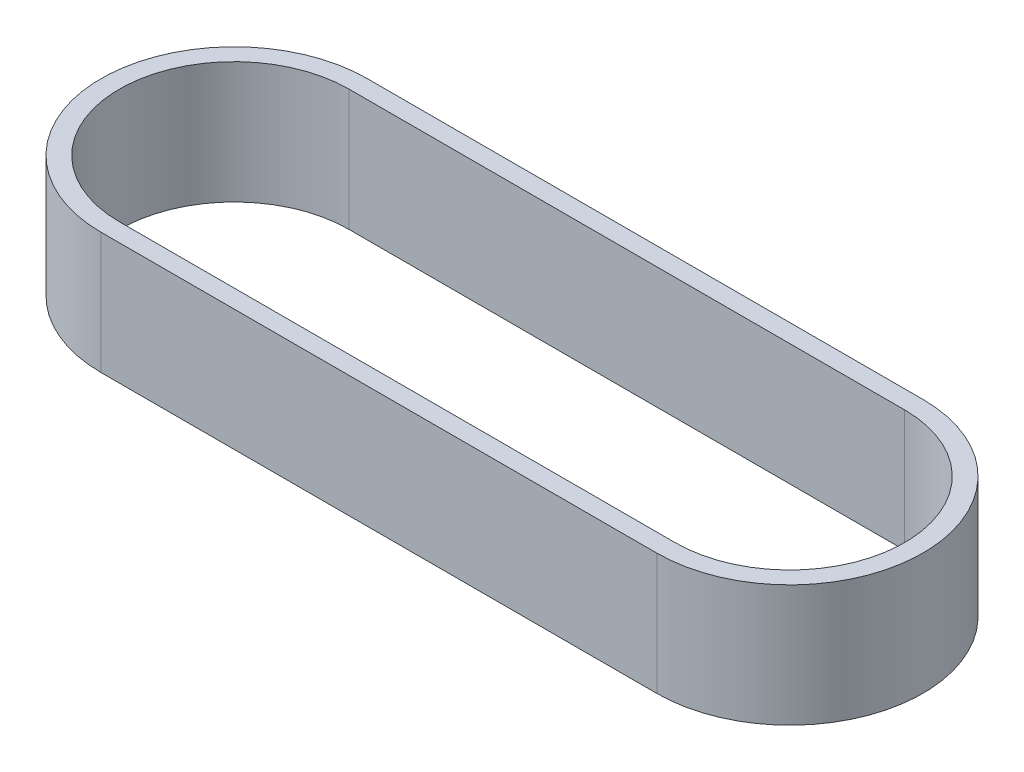
ISO-10303-21;
HEADER;
FILE_DESCRIPTION(('STEP AP214'),'2;1');
FILE_NAME('part.step','',(''),(''),'','','');
FILE_SCHEMA(('AUTOMOTIVE_DESIGN { 1 0 10303 214 1 1 1 1 }'));
ENDSEC;
DATA;
#1=APPLICATION_CONTEXT('core data for automotive mechanical design processes');
#2=APPLICATION_PROTOCOL_DEFINITION('international standard','automotive_design',2000,#1);
#3=PRODUCT_CONTEXT('',#1,'mechanical');
#4=PRODUCT('Part','Part','',(#3));
#5=PRODUCT_RELATED_PRODUCT_CATEGORY('part','',(#4));
#6=PRODUCT_DEFINITION_FORMATION('','',#4);
#7=PRODUCT_DEFINITION_CONTEXT('part definition',#1,'design');
#8=PRODUCT_DEFINITION('design','',#6,#7);
#9=PRODUCT_DEFINITION_SHAPE('','',#8);
#10=(LENGTH_UNIT() NAMED_UNIT(*) SI_UNIT(.MILLI.,.METRE.));
#11=(NAMED_UNIT(*) PLANE_ANGLE_UNIT() SI_UNIT($,.RADIAN.));
#12=(NAMED_UNIT(*) SI_UNIT($,.STERADIAN.) SOLID_ANGLE_UNIT());
#13=UNCERTAINTY_MEASURE_WITH_UNIT(LENGTH_MEASURE(1.E-05),#10,'distance_accuracy_value','');
#14=(GEOMETRIC_REPRESENTATION_CONTEXT(3) GLOBAL_UNCERTAINTY_ASSIGNED_CONTEXT((#13)) GLOBAL_UNIT_ASSIGNED_CONTEXT((#10,
#11,#12)) REPRESENTATION_CONTEXT('',''));
#15=CARTESIAN_POINT('',(0.,0.,0.));
#16=DIRECTION('',(0.,0.,1.));
#17=DIRECTION('',(1.,0.,0.));
#18=AXIS2_PLACEMENT_3D('',#15,#16,#17);
#19=CARTESIAN_POINT('',(0.,10.,0.));
#20=DIRECTION('',(0.,1.,0.));
#21=DIRECTION('',(0.,0.,1.));
#22=AXIS2_PLACEMENT_3D('',#19,#20,#21);
#23=PLANE('',#22);
#24=CARTESIAN_POINT('',(0.,10.,0.));
#25=DIRECTION('',(0.,1.,0.));
#26=DIRECTION('',(0.,0.,1.));
#27=AXIS2_PLACEMENT_3D('',#24,#25,#26);
#28=CIRCLE('',#27,10.95);
#29=CARTESIAN_POINT('',(0.,10.,-10.95));
#30=VERTEX_POINT('',#29);
#31=CARTESIAN_POINT('',(0.,10.,10.95));
#32=VERTEX_POINT('',#31);
#33=EDGE_CURVE('E138',#30,#32,#28,.T.);
#34=ORIENTED_EDGE('',*,*,#33,.T.);
#35=DIRECTION('',(1.,0.,0.));
#36=VECTOR('',#35,1.);
#37=CARTESIAN_POINT('',(0.,10.,10.95));
#38=LINE('',#37,#36);
#39=CARTESIAN_POINT('',(45.72,10.,10.95));
#40=VERTEX_POINT('',#39);
#41=EDGE_CURVE('E141',#32,#40,#38,.T.);
#42=ORIENTED_EDGE('',*,*,#41,.T.);
#43=CARTESIAN_POINT('',(45.72,10.,0.));
#44=DIRECTION('',(0.,1.,0.));
#45=DIRECTION('',(0.,0.,1.));
#46=AXIS2_PLACEMENT_3D('',#43,#44,#45);
#47=CIRCLE('',#46,10.95);
#48=CARTESIAN_POINT('',(45.72,10.,-10.95));
#49=VERTEX_POINT('',#48);
#50=EDGE_CURVE('E144',#40,#49,#47,.T.);
#51=ORIENTED_EDGE('',*,*,#50,.T.);
#52=DIRECTION('',(-1.,0.,0.));
#53=VECTOR('',#52,1.);
#54=CARTESIAN_POINT('',(0.,10.,-10.95));
#55=LINE('',#54,#53);
#56=EDGE_CURVE('E146',#49,#30,#55,.T.);
#57=ORIENTED_EDGE('',*,*,#56,.T.);
#58=EDGE_LOOP('',(#34,#42,#51,#57));
#59=FACE_BOUND('',#58,.T.);
#60=DIRECTION('',(1.,0.,0.));
#61=VECTOR('',#60,1.);
#62=CARTESIAN_POINT('',(0.,10.,9.45));
#63=LINE('',#62,#61);
#64=CARTESIAN_POINT('',(0.,10.,9.45));
#65=VERTEX_POINT('',#64);
#66=CARTESIAN_POINT('',(45.72,10.,9.45));
#67=VERTEX_POINT('',#66);
#68=EDGE_CURVE('E110',#65,#67,#63,.T.);
#69=ORIENTED_EDGE('',*,*,#68,.F.);
#70=CARTESIAN_POINT('',(0.,10.,0.));
#71=DIRECTION('',(0.,1.,0.));
#72=DIRECTION('',(0.,0.,1.));
#73=AXIS2_PLACEMENT_3D('',#70,#71,#72);
#74=CIRCLE('',#73,9.45);
#75=CARTESIAN_POINT('',(0.,10.,-9.45));
#76=VERTEX_POINT('',#75);
#77=EDGE_CURVE('E102',#76,#65,#74,.T.);
#78=ORIENTED_EDGE('',*,*,#77,.F.);
#79=DIRECTION('',(-1.,0.,0.));
#80=VECTOR('',#79,1.);
#81=CARTESIAN_POINT('',(0.,10.,-9.45));
#82=LINE('',#81,#80);
#83=CARTESIAN_POINT('',(45.72,10.,-9.45));
#84=VERTEX_POINT('',#83);
#85=EDGE_CURVE('E124',#84,#76,#82,.T.);
#86=ORIENTED_EDGE('',*,*,#85,.F.);
#87=CARTESIAN_POINT('',(45.72,10.,0.));
#88=DIRECTION('',(0.,1.,0.));
#89=DIRECTION('',(0.,0.,1.));
#90=AXIS2_PLACEMENT_3D('',#87,#88,#89);
#91=CIRCLE('',#90,9.45);
#92=EDGE_CURVE('E122',#67,#84,#91,.T.);
#93=ORIENTED_EDGE('',*,*,#92,.F.);
#94=EDGE_LOOP('',(#69,#78,#86,#93));
#95=FACE_BOUND('',#94,.T.);
#96=ADVANCED_FACE('F37',(#59,#95),#23,.T.);
#97=CARTESIAN_POINT('',(0.,0.,0.));
#98=DIRECTION('',(0.,1.,0.));
#99=DIRECTION('',(0.,0.,1.));
#100=AXIS2_PLACEMENT_3D('',#97,#98,#99);
#101=PLANE('',#100);
#102=CARTESIAN_POINT('',(0.,0.,0.));
#103=DIRECTION('',(0.,1.,0.));
#104=DIRECTION('',(0.,0.,1.));
#105=AXIS2_PLACEMENT_3D('',#102,#103,#104);
#106=CIRCLE('',#105,10.95);
#107=CARTESIAN_POINT('',(0.,0.,-10.95));
#108=VERTEX_POINT('',#107);
#109=CARTESIAN_POINT('',(0.,0.,10.95));
#110=VERTEX_POINT('',#109);
#111=EDGE_CURVE('E118',#108,#110,#106,.T.);
#112=ORIENTED_EDGE('',*,*,#111,.F.);
#113=DIRECTION('',(-1.,0.,0.));
#114=VECTOR('',#113,1.);
#115=CARTESIAN_POINT('',(0.,0.,-10.95));
#116=LINE('',#115,#114);
#117=CARTESIAN_POINT('',(45.72,0.,-10.95));
#118=VERTEX_POINT('',#117);
#119=EDGE_CURVE('E142',#118,#108,#116,.T.);
#120=ORIENTED_EDGE('',*,*,#119,.F.);
#121=CARTESIAN_POINT('',(45.72,0.,0.));
#122=DIRECTION('',(0.,1.,0.));
#123=DIRECTION('',(0.,0.,1.));
#124=AXIS2_PLACEMENT_3D('',#121,#122,#123);
#125=CIRCLE('',#124,10.95);
#126=CARTESIAN_POINT('',(45.72,0.,10.95));
#127=VERTEX_POINT('',#126);
#128=EDGE_CURVE('E153',#127,#118,#125,.T.);
#129=ORIENTED_EDGE('',*,*,#128,.F.);
#130=DIRECTION('',(1.,0.,0.));
#131=VECTOR('',#130,1.);
#132=CARTESIAN_POINT('',(0.,0.,10.95));
#133=LINE('',#132,#131);
#134=EDGE_CURVE('E151',#110,#127,#133,.T.);
#135=ORIENTED_EDGE('',*,*,#134,.F.);
#136=EDGE_LOOP('',(#112,#120,#129,#135));
#137=FACE_BOUND('',#136,.T.);
#138=CARTESIAN_POINT('',(0.,0.,0.));
#139=DIRECTION('',(0.,1.,0.));
#140=DIRECTION('',(0.,0.,1.));
#141=AXIS2_PLACEMENT_3D('',#138,#139,#140);
#142=CIRCLE('',#141,9.45);
#143=CARTESIAN_POINT('',(0.,0.,-9.45));
#144=VERTEX_POINT('',#143);
#145=CARTESIAN_POINT('',(0.,0.,9.45));
#146=VERTEX_POINT('',#145);
#147=EDGE_CURVE('E60',#144,#146,#142,.T.);
#148=ORIENTED_EDGE('',*,*,#147,.T.);
#149=DIRECTION('',(1.,0.,0.));
#150=VECTOR('',#149,1.);
#151=CARTESIAN_POINT('',(0.,0.,9.45));
#152=LINE('',#151,#150);
#153=CARTESIAN_POINT('',(45.72,0.,9.45));
#154=VERTEX_POINT('',#153);
#155=EDGE_CURVE('E117',#146,#154,#152,.T.);
#156=ORIENTED_EDGE('',*,*,#155,.T.);
#157=CARTESIAN_POINT('',(45.72,0.,0.));
#158=DIRECTION('',(0.,1.,0.));
#159=DIRECTION('',(0.,0.,1.));
#160=AXIS2_PLACEMENT_3D('',#157,#158,#159);
#161=CIRCLE('',#160,9.45);
#162=CARTESIAN_POINT('',(45.72,0.,-9.45));
#163=VERTEX_POINT('',#162);
#164=EDGE_CURVE('E130',#154,#163,#161,.T.);
#165=ORIENTED_EDGE('',*,*,#164,.T.);
#166=DIRECTION('',(-1.,0.,0.));
#167=VECTOR('',#166,1.);
#168=CARTESIAN_POINT('',(0.,0.,-9.45));
#169=LINE('',#168,#167);
#170=EDGE_CURVE('E111',#163,#144,#169,.T.);
#171=ORIENTED_EDGE('',*,*,#170,.T.);
#172=EDGE_LOOP('',(#148,#156,#165,#171));
#173=FACE_BOUND('',#172,.T.);
#174=ADVANCED_FACE('F171',(#137,#173),#101,.F.);
#175=CARTESIAN_POINT('',(0.,10.,0.));
#176=DIRECTION('',(0.,-1.,0.));
#177=DIRECTION('',(0.,0.,-1.));
#178=AXIS2_PLACEMENT_3D('',#175,#176,#177);
#179=CYLINDRICAL_SURFACE('',#178,10.95);
#180=ORIENTED_EDGE('',*,*,#111,.T.);
#181=DIRECTION('',(0.,-1.,0.));
#182=VECTOR('',#181,1.);
#183=CARTESIAN_POINT('',(0.,10.,10.95));
#184=LINE('',#183,#182);
#185=EDGE_CURVE('E11',#32,#110,#184,.T.);
#186=ORIENTED_EDGE('',*,*,#185,.F.);
#187=ORIENTED_EDGE('',*,*,#33,.F.);
#188=DIRECTION('',(0.,-1.,0.));
#189=VECTOR('',#188,1.);
#190=CARTESIAN_POINT('',(0.,10.,-10.95));
#191=LINE('',#190,#189);
#192=EDGE_CURVE('E148',#30,#108,#191,.T.);
#193=ORIENTED_EDGE('',*,*,#192,.T.);
#194=EDGE_LOOP('',(#180,#186,#187,#193));
#195=FACE_BOUND('',#194,.T.);
#196=ADVANCED_FACE('F39',(#195),#179,.T.);
#197=CARTESIAN_POINT('',(0.,10.,10.95));
#198=DIRECTION('',(0.,0.,-1.));
#199=DIRECTION('',(-1.,0.,0.));
#200=AXIS2_PLACEMENT_3D('',#197,#198,#199);
#201=PLANE('',#200);
#202=ORIENTED_EDGE('',*,*,#134,.T.);
#203=DIRECTION('',(0.,-1.,0.));
#204=VECTOR('',#203,1.);
#205=CARTESIAN_POINT('',(45.72,10.,10.95));
#206=LINE('',#205,#204);
#207=EDGE_CURVE('E45',#40,#127,#206,.T.);
#208=ORIENTED_EDGE('',*,*,#207,.F.);
#209=ORIENTED_EDGE('',*,*,#41,.F.);
#210=ORIENTED_EDGE('',*,*,#185,.T.);
#211=EDGE_LOOP('',(#202,#208,#209,#210));
#212=FACE_BOUND('',#211,.T.);
#213=ADVANCED_FACE('F181',(#212),#201,.F.);
#214=CARTESIAN_POINT('',(45.72,10.,0.));
#215=DIRECTION('',(0.,-1.,0.));
#216=DIRECTION('',(0.,0.,-1.));
#217=AXIS2_PLACEMENT_3D('',#214,#215,#216);
#218=CYLINDRICAL_SURFACE('',#217,10.95);
#219=ORIENTED_EDGE('',*,*,#128,.T.);
#220=DIRECTION('',(0.,-1.,0.));
#221=VECTOR('',#220,1.);
#222=CARTESIAN_POINT('',(45.72,10.,-10.95));
#223=LINE('',#222,#221);
#224=EDGE_CURVE('E158',#49,#118,#223,.T.);
#225=ORIENTED_EDGE('',*,*,#224,.F.);
#226=ORIENTED_EDGE('',*,*,#50,.F.);
#227=ORIENTED_EDGE('',*,*,#207,.T.);
#228=EDGE_LOOP('',(#219,#225,#226,#227));
#229=FACE_BOUND('',#228,.T.);
#230=ADVANCED_FACE('F165',(#229),#218,.T.);
#231=CARTESIAN_POINT('',(0.,10.,-10.95));
#232=DIRECTION('',(0.,0.,1.));
#233=DIRECTION('',(1.,0.,0.));
#234=AXIS2_PLACEMENT_3D('',#231,#232,#233);
#235=PLANE('',#234);
#236=ORIENTED_EDGE('',*,*,#119,.T.);
#237=ORIENTED_EDGE('',*,*,#192,.F.);
#238=ORIENTED_EDGE('',*,*,#56,.F.);
#239=ORIENTED_EDGE('',*,*,#224,.T.);
#240=EDGE_LOOP('',(#236,#237,#238,#239));
#241=FACE_BOUND('',#240,.T.);
#242=ADVANCED_FACE('F175',(#241),#235,.F.);
#243=CARTESIAN_POINT('',(0.,10.,0.));
#244=DIRECTION('',(0.,-1.,0.));
#245=DIRECTION('',(0.,0.,-1.));
#246=AXIS2_PLACEMENT_3D('',#243,#244,#245);
#247=CYLINDRICAL_SURFACE('',#246,9.45);
#248=ORIENTED_EDGE('',*,*,#147,.F.);
#249=DIRECTION('',(0.,-1.,0.));
#250=VECTOR('',#249,1.);
#251=CARTESIAN_POINT('',(0.,10.,-9.45));
#252=LINE('',#251,#250);
#253=EDGE_CURVE('E106',#76,#144,#252,.T.);
#254=ORIENTED_EDGE('',*,*,#253,.F.);
#255=ORIENTED_EDGE('',*,*,#77,.T.);
#256=DIRECTION('',(0.,-1.,0.));
#257=VECTOR('',#256,1.);
#258=CARTESIAN_POINT('',(0.,10.,9.45));
#259=LINE('',#258,#257);
#260=EDGE_CURVE('E105',#65,#146,#259,.T.);
#261=ORIENTED_EDGE('',*,*,#260,.T.);
#262=EDGE_LOOP('',(#248,#254,#255,#261));
#263=FACE_BOUND('',#262,.T.);
#264=ADVANCED_FACE('F104',(#263),#247,.F.);
#265=CARTESIAN_POINT('',(0.,10.,9.45));
#266=DIRECTION('',(0.,0.,-1.));
#267=DIRECTION('',(-1.,0.,0.));
#268=AXIS2_PLACEMENT_3D('',#265,#266,#267);
#269=PLANE('',#268);
#270=ORIENTED_EDGE('',*,*,#155,.F.);
#271=ORIENTED_EDGE('',*,*,#260,.F.);
#272=ORIENTED_EDGE('',*,*,#68,.T.);
#273=DIRECTION('',(0.,-1.,0.));
#274=VECTOR('',#273,1.);
#275=CARTESIAN_POINT('',(45.72,10.,9.45));
#276=LINE('',#275,#274);
#277=EDGE_CURVE('E119',#67,#154,#276,.T.);
#278=ORIENTED_EDGE('',*,*,#277,.T.);
#279=EDGE_LOOP('',(#270,#271,#272,#278));
#280=FACE_BOUND('',#279,.T.);
#281=ADVANCED_FACE('F114',(#280),#269,.T.);
#282=CARTESIAN_POINT('',(45.72,10.,0.));
#283=DIRECTION('',(0.,-1.,0.));
#284=DIRECTION('',(0.,0.,-1.));
#285=AXIS2_PLACEMENT_3D('',#282,#283,#284);
#286=CYLINDRICAL_SURFACE('',#285,9.45);
#287=ORIENTED_EDGE('',*,*,#164,.F.);
#288=ORIENTED_EDGE('',*,*,#277,.F.);
#289=ORIENTED_EDGE('',*,*,#92,.T.);
#290=DIRECTION('',(0.,-1.,0.));
#291=VECTOR('',#290,1.);
#292=CARTESIAN_POINT('',(45.72,10.,-9.45));
#293=LINE('',#292,#291);
#294=EDGE_CURVE('E52',#84,#163,#293,.T.);
#295=ORIENTED_EDGE('',*,*,#294,.T.);
#296=EDGE_LOOP('',(#287,#288,#289,#295));
#297=FACE_BOUND('',#296,.T.);
#298=ADVANCED_FACE('F204',(#297),#286,.F.);
#299=CARTESIAN_POINT('',(0.,10.,-9.45));
#300=DIRECTION('',(0.,0.,1.));
#301=DIRECTION('',(1.,0.,0.));
#302=AXIS2_PLACEMENT_3D('',#299,#300,#301);
#303=PLANE('',#302);
#304=ORIENTED_EDGE('',*,*,#170,.F.);
#305=ORIENTED_EDGE('',*,*,#294,.F.);
#306=ORIENTED_EDGE('',*,*,#85,.T.);
#307=ORIENTED_EDGE('',*,*,#253,.T.);
#308=EDGE_LOOP('',(#304,#305,#306,#307));
#309=FACE_BOUND('',#308,.T.);
#310=ADVANCED_FACE('F208',(#309),#303,.T.);
#311=CLOSED_SHELL('',(#96,#174,#196,#213,#230,#242,#264,#281,#298,#310));
#312=MANIFOLD_SOLID_BREP('B2',#311);
#313=ADVANCED_BREP_SHAPE_REPRESENTATION('',(#18,#312),#14);
#314=SHAPE_DEFINITION_REPRESENTATION(#9,#313);
ENDSEC;
END-ISO-10303-21;
